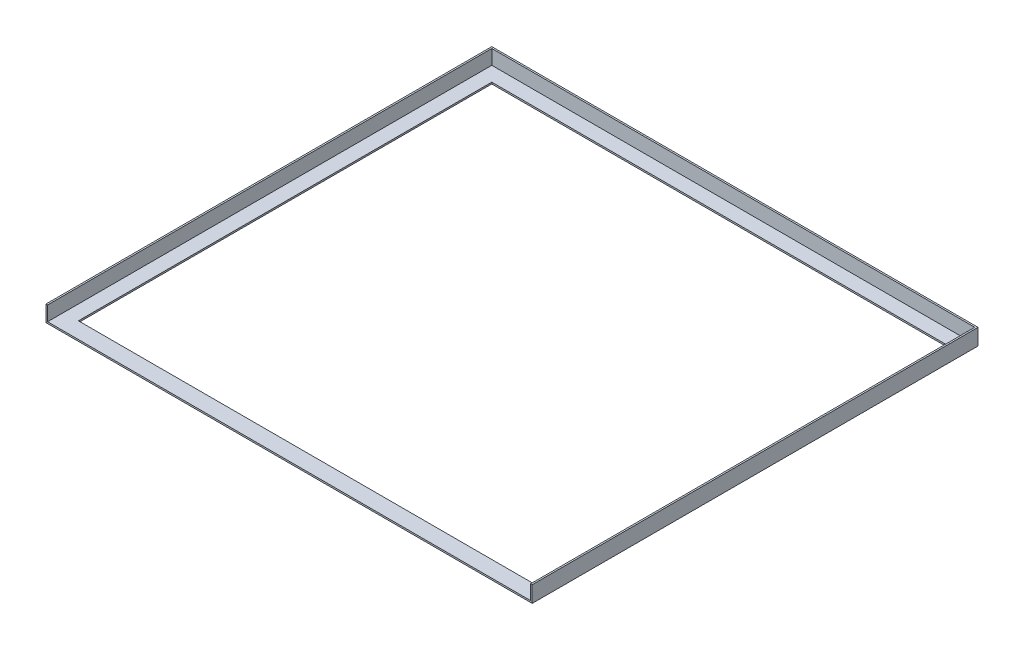
ISO-10303-21;
HEADER;
FILE_DESCRIPTION(('STEP AP214'),'2;1');
FILE_NAME('part.step','',(''),(''),'','','');
FILE_SCHEMA(('AUTOMOTIVE_DESIGN { 1 0 10303 214 1 1 1 1 }'));
ENDSEC;
DATA;
#1=APPLICATION_CONTEXT('core data for automotive mechanical design processes');
#2=APPLICATION_PROTOCOL_DEFINITION('international standard','automotive_design',2000,#1);
#3=PRODUCT_CONTEXT('',#1,'mechanical');
#4=PRODUCT('Part','Part','',(#3));
#5=PRODUCT_RELATED_PRODUCT_CATEGORY('part','',(#4));
#6=PRODUCT_DEFINITION_FORMATION('','',#4);
#7=PRODUCT_DEFINITION_CONTEXT('part definition',#1,'design');
#8=PRODUCT_DEFINITION('design','',#6,#7);
#9=PRODUCT_DEFINITION_SHAPE('','',#8);
#10=(LENGTH_UNIT() NAMED_UNIT(*) SI_UNIT(.MILLI.,.METRE.));
#11=(NAMED_UNIT(*) PLANE_ANGLE_UNIT() SI_UNIT($,.RADIAN.));
#12=(NAMED_UNIT(*) SI_UNIT($,.STERADIAN.) SOLID_ANGLE_UNIT());
#13=UNCERTAINTY_MEASURE_WITH_UNIT(LENGTH_MEASURE(1.E-05),#10,'distance_accuracy_value','');
#14=(GEOMETRIC_REPRESENTATION_CONTEXT(3) GLOBAL_UNCERTAINTY_ASSIGNED_CONTEXT((#13)) GLOBAL_UNIT_ASSIGNED_CONTEXT((#10,
#11,#12)) REPRESENTATION_CONTEXT('',''));
#15=CARTESIAN_POINT('',(0.,0.,0.));
#16=DIRECTION('',(0.,0.,1.));
#17=DIRECTION('',(1.,0.,0.));
#18=AXIS2_PLACEMENT_3D('',#15,#16,#17);
#19=CARTESIAN_POINT('',(-78.9001000112778,15.6650035046458,-550.1));
#20=DIRECTION('',(-1.,0.,0.));
#21=DIRECTION('',(0.,0.,1.));
#22=AXIS2_PLACEMENT_3D('',#19,#20,#21);
#23=PLANE('',#22);
#24=DIRECTION('',(0.,-1.,0.));
#25=VECTOR('',#24,1.);
#26=CARTESIAN_POINT('',(-78.9001000112778,15.6650035046458,0.));
#27=LINE('',#26,#25);
#28=CARTESIAN_POINT('',(-78.9001000112778,15.6650035046458,0.));
#29=VERTEX_POINT('',#28);
#30=CARTESIAN_POINT('',(-78.9001000112778,-4.33499649535423,0.));
#31=VERTEX_POINT('',#30);
#32=EDGE_CURVE('E182',#29,#31,#27,.T.);
#33=ORIENTED_EDGE('',*,*,#32,.F.);
#34=DIRECTION('',(0.,0.,1.));
#35=VECTOR('',#34,1.);
#36=CARTESIAN_POINT('',(-78.9001000112778,15.6650035046458,-550.1));
#37=LINE('',#36,#35);
#38=CARTESIAN_POINT('',(-78.9001000112778,15.6650035046458,-550.1));
#39=VERTEX_POINT('',#38);
#40=EDGE_CURVE('E12',#39,#29,#37,.T.);
#41=ORIENTED_EDGE('',*,*,#40,.F.);
#42=DIRECTION('',(0.,-1.,0.));
#43=VECTOR('',#42,1.);
#44=CARTESIAN_POINT('',(-78.9001000112778,15.6650035046458,-550.1));
#45=LINE('',#44,#43);
#46=CARTESIAN_POINT('',(-78.9001000112778,-4.33499649535423,-550.1));
#47=VERTEX_POINT('',#46);
#48=EDGE_CURVE('E160',#39,#47,#45,.T.);
#49=ORIENTED_EDGE('',*,*,#48,.T.);
#50=DIRECTION('',(0.,0.,1.));
#51=VECTOR('',#50,1.);
#52=CARTESIAN_POINT('',(-78.9001000112778,-4.33499649535423,-550.1));
#53=LINE('',#52,#51);
#54=EDGE_CURVE('E44',#47,#31,#53,.T.);
#55=ORIENTED_EDGE('',*,*,#54,.T.);
#56=EDGE_LOOP('',(#33,#41,#49,#55));
#57=FACE_BOUND('',#56,.T.);
#58=ADVANCED_FACE('F41',(#57),#23,.T.);
#59=CARTESIAN_POINT('',(-78.9001000112778,15.6650035046458,-550.1));
#60=DIRECTION('',(0.,1.,0.));
#61=DIRECTION('',(0.,0.,1.));
#62=AXIS2_PLACEMENT_3D('',#59,#60,#61);
#63=PLANE('',#62);
#64=DIRECTION('',(-1.,0.,0.));
#65=VECTOR('',#64,1.);
#66=CARTESIAN_POINT('',(-78.9001000112778,15.6650035046458,0.));
#67=LINE('',#66,#65);
#68=CARTESIAN_POINT('',(-76.9001000112778,15.6650035046458,0.));
#69=VERTEX_POINT('',#68);
#70=EDGE_CURVE('E147',#69,#29,#67,.T.);
#71=ORIENTED_EDGE('',*,*,#70,.F.);
#72=DIRECTION('',(0.,0.,-1.));
#73=VECTOR('',#72,1.);
#74=CARTESIAN_POINT('',(-76.9001000112778,15.6650035046458,-548.1));
#75=LINE('',#74,#73);
#76=CARTESIAN_POINT('',(-76.9001000112778,15.6650035046458,-548.1));
#77=VERTEX_POINT('',#76);
#78=EDGE_CURVE('E131',#69,#77,#75,.T.);
#79=ORIENTED_EDGE('',*,*,#78,.T.);
#80=DIRECTION('',(1.,0.,0.));
#81=VECTOR('',#80,1.);
#82=CARTESIAN_POINT('',(519.099899988722,15.6650035046458,-548.1));
#83=LINE('',#82,#81);
#84=CARTESIAN_POINT('',(519.099899988722,15.6650035046458,-548.1));
#85=VERTEX_POINT('',#84);
#86=EDGE_CURVE('E197',#77,#85,#83,.T.);
#87=ORIENTED_EDGE('',*,*,#86,.T.);
#88=DIRECTION('',(0.,0.,1.));
#89=VECTOR('',#88,1.);
#90=CARTESIAN_POINT('',(519.099899988722,15.6650035046458,-548.1));
#91=LINE('',#90,#89);
#92=CARTESIAN_POINT('',(519.099899988722,15.6650035046458,0.));
#93=VERTEX_POINT('',#92);
#94=EDGE_CURVE('E183',#85,#93,#91,.T.);
#95=ORIENTED_EDGE('',*,*,#94,.T.);
#96=CARTESIAN_POINT('',(521.099899988722,15.6650035046458,0.));
#97=VERTEX_POINT('',#96);
#98=EDGE_CURVE('E156',#97,#93,#67,.T.);
#99=ORIENTED_EDGE('',*,*,#98,.F.);
#100=DIRECTION('',(0.,0.,1.));
#101=VECTOR('',#100,1.);
#102=CARTESIAN_POINT('',(521.099899988722,15.6650035046458,-550.1));
#103=LINE('',#102,#101);
#104=CARTESIAN_POINT('',(521.099899988722,15.6650035046458,-550.1));
#105=VERTEX_POINT('',#104);
#106=EDGE_CURVE('E49',#105,#97,#103,.T.);
#107=ORIENTED_EDGE('',*,*,#106,.F.);
#108=DIRECTION('',(-1.,0.,0.));
#109=VECTOR('',#108,1.);
#110=CARTESIAN_POINT('',(-78.9001000112778,15.6650035046458,-550.1));
#111=LINE('',#110,#109);
#112=EDGE_CURVE('E171',#105,#39,#111,.T.);
#113=ORIENTED_EDGE('',*,*,#112,.T.);
#114=ORIENTED_EDGE('',*,*,#40,.T.);
#115=EDGE_LOOP('',(#71,#79,#87,#95,#99,#107,#113,#114));
#116=FACE_BOUND('',#115,.T.);
#117=ADVANCED_FACE('F153',(#116),#63,.T.);
#118=CARTESIAN_POINT('',(521.099899988722,15.6650035046458,-550.1));
#119=DIRECTION('',(1.,0.,0.));
#120=DIRECTION('',(0.,0.,-1.));
#121=AXIS2_PLACEMENT_3D('',#118,#119,#120);
#122=PLANE('',#121);
#123=DIRECTION('',(0.,1.,0.));
#124=VECTOR('',#123,1.);
#125=CARTESIAN_POINT('',(521.099899988722,15.6650035046458,0.));
#126=LINE('',#125,#124);
#127=CARTESIAN_POINT('',(521.099899988722,-4.33499649535423,0.));
#128=VERTEX_POINT('',#127);
#129=EDGE_CURVE('E157',#128,#97,#126,.T.);
#130=ORIENTED_EDGE('',*,*,#129,.F.);
#131=DIRECTION('',(0.,0.,1.));
#132=VECTOR('',#131,1.);
#133=CARTESIAN_POINT('',(521.099899988722,-4.33499649535423,-550.1));
#134=LINE('',#133,#132);
#135=CARTESIAN_POINT('',(521.099899988722,-4.33499649535423,-550.1));
#136=VERTEX_POINT('',#135);
#137=EDGE_CURVE('E166',#136,#128,#134,.T.);
#138=ORIENTED_EDGE('',*,*,#137,.F.);
#139=DIRECTION('',(0.,1.,0.));
#140=VECTOR('',#139,1.);
#141=CARTESIAN_POINT('',(521.099899988722,15.6650035046458,-550.1));
#142=LINE('',#141,#140);
#143=EDGE_CURVE('E174',#136,#105,#142,.T.);
#144=ORIENTED_EDGE('',*,*,#143,.T.);
#145=ORIENTED_EDGE('',*,*,#106,.T.);
#146=EDGE_LOOP('',(#130,#138,#144,#145));
#147=FACE_BOUND('',#146,.T.);
#148=ADVANCED_FACE('F285',(#147),#122,.T.);
#149=CARTESIAN_POINT('',(-78.9001000112778,-4.33499649535423,-550.1));
#150=DIRECTION('',(0.,-1.,0.));
#151=DIRECTION('',(1.,0.,0.));
#152=AXIS2_PLACEMENT_3D('',#149,#150,#151);
#153=PLANE('',#152);
#154=DIRECTION('',(-1.,0.,0.));
#155=VECTOR('',#154,1.);
#156=CARTESIAN_POINT('',(501.099899988722,-4.33499649535428,-20.));
#157=LINE('',#156,#155);
#158=CARTESIAN_POINT('',(501.099899988722,-4.33499649535428,-20.));
#159=VERTEX_POINT('',#158);
#160=CARTESIAN_POINT('',(-58.9001000112778,-4.33499649535423,-20.));
#161=VERTEX_POINT('',#160);
#162=EDGE_CURVE('E228',#159,#161,#157,.T.);
#163=ORIENTED_EDGE('',*,*,#162,.F.);
#164=DIRECTION('',(0.,0.,1.));
#165=VECTOR('',#164,1.);
#166=CARTESIAN_POINT('',(501.099899988722,-4.33499649535428,-530.1));
#167=LINE('',#166,#165);
#168=CARTESIAN_POINT('',(501.099899988722,-4.33499649535428,-530.1));
#169=VERTEX_POINT('',#168);
#170=EDGE_CURVE('E231',#169,#159,#167,.T.);
#171=ORIENTED_EDGE('',*,*,#170,.F.);
#172=DIRECTION('',(1.,0.,0.));
#173=VECTOR('',#172,1.);
#174=CARTESIAN_POINT('',(-58.9001000112778,-4.33499649535428,-530.1));
#175=LINE('',#174,#173);
#176=CARTESIAN_POINT('',(-58.9001000112778,-4.33499649535428,-530.1));
#177=VERTEX_POINT('',#176);
#178=EDGE_CURVE('E239',#177,#169,#175,.T.);
#179=ORIENTED_EDGE('',*,*,#178,.F.);
#180=DIRECTION('',(0.,0.,-1.));
#181=VECTOR('',#180,1.);
#182=CARTESIAN_POINT('',(-58.9001000112778,-4.33499649535428,-20.));
#183=LINE('',#182,#181);
#184=EDGE_CURVE('E249',#161,#177,#183,.T.);
#185=ORIENTED_EDGE('',*,*,#184,.F.);
#186=EDGE_LOOP('',(#163,#171,#179,#185));
#187=FACE_BOUND('',#186,.T.);
#188=DIRECTION('',(1.,0.,0.));
#189=VECTOR('',#188,1.);
#190=CARTESIAN_POINT('',(-78.9001000112778,-4.33499649535423,0.));
#191=LINE('',#190,#189);
#192=EDGE_CURVE('E162',#31,#128,#191,.T.);
#193=ORIENTED_EDGE('',*,*,#192,.F.);
#194=ORIENTED_EDGE('',*,*,#54,.F.);
#195=DIRECTION('',(1.,0.,0.));
#196=VECTOR('',#195,1.);
#197=CARTESIAN_POINT('',(-78.9001000112778,-4.33499649535423,-550.1));
#198=LINE('',#197,#196);
#199=EDGE_CURVE('E178',#47,#136,#198,.T.);
#200=ORIENTED_EDGE('',*,*,#199,.T.);
#201=ORIENTED_EDGE('',*,*,#137,.T.);
#202=EDGE_LOOP('',(#193,#194,#200,#201));
#203=FACE_BOUND('',#202,.T.);
#204=ADVANCED_FACE('F186',(#187,#203),#153,.T.);
#205=CARTESIAN_POINT('',(0.,0.,-550.1));
#206=DIRECTION('',(0.,0.,1.));
#207=DIRECTION('',(1.,0.,0.));
#208=AXIS2_PLACEMENT_3D('',#205,#206,#207);
#209=PLANE('',#208);
#210=ORIENTED_EDGE('',*,*,#48,.F.);
#211=ORIENTED_EDGE('',*,*,#112,.F.);
#212=ORIENTED_EDGE('',*,*,#143,.F.);
#213=ORIENTED_EDGE('',*,*,#199,.F.);
#214=EDGE_LOOP('',(#210,#211,#212,#213));
#215=FACE_BOUND('',#214,.T.);
#216=ADVANCED_FACE('F191',(#215),#209,.F.);
#217=CARTESIAN_POINT('',(0.,0.,0.));
#218=DIRECTION('',(0.,0.,1.));
#219=DIRECTION('',(1.,0.,0.));
#220=AXIS2_PLACEMENT_3D('',#217,#218,#219);
#221=PLANE('',#220);
#222=DIRECTION('',(0.,1.,0.));
#223=VECTOR('',#222,1.);
#224=CARTESIAN_POINT('',(-76.9001000112778,15.6650035046458,0.));
#225=LINE('',#224,#223);
#226=CARTESIAN_POINT('',(-76.9001000112778,-2.33499649535423,0.));
#227=VERTEX_POINT('',#226);
#228=EDGE_CURVE('E134',#227,#69,#225,.T.);
#229=ORIENTED_EDGE('',*,*,#228,.T.);
#230=ORIENTED_EDGE('',*,*,#70,.T.);
#231=ORIENTED_EDGE('',*,*,#32,.T.);
#232=ORIENTED_EDGE('',*,*,#192,.T.);
#233=ORIENTED_EDGE('',*,*,#129,.T.);
#234=ORIENTED_EDGE('',*,*,#98,.T.);
#235=DIRECTION('',(0.,-1.,0.));
#236=VECTOR('',#235,1.);
#237=CARTESIAN_POINT('',(519.099899988722,15.6650035046458,0.));
#238=LINE('',#237,#236);
#239=CARTESIAN_POINT('',(519.099899988722,-2.33499649535423,0.));
#240=VERTEX_POINT('',#239);
#241=EDGE_CURVE('E151',#93,#240,#238,.T.);
#242=ORIENTED_EDGE('',*,*,#241,.T.);
#243=DIRECTION('',(-1.,0.,0.));
#244=VECTOR('',#243,1.);
#245=CARTESIAN_POINT('',(-76.9001000112778,-2.33499649535423,0.));
#246=LINE('',#245,#244);
#247=EDGE_CURVE('E150',#240,#227,#246,.T.);
#248=ORIENTED_EDGE('',*,*,#247,.T.);
#249=EDGE_LOOP('',(#229,#230,#231,#232,#233,#234,#242,#248));
#250=FACE_BOUND('',#249,.T.);
#251=ADVANCED_FACE('F145',(#250),#221,.T.);
#252=CARTESIAN_POINT('',(0.,-2.33499649535428,0.));
#253=DIRECTION('',(0.,-1.,0.));
#254=DIRECTION('',(0.,0.,-1.));
#255=AXIS2_PLACEMENT_3D('',#252,#253,#254);
#256=PLANE('',#255);
#257=DIRECTION('',(0.,0.,1.));
#258=VECTOR('',#257,1.);
#259=CARTESIAN_POINT('',(501.099899988722,-2.33499649535428,-530.1));
#260=LINE('',#259,#258);
#261=CARTESIAN_POINT('',(501.099899988722,-2.33499649535428,-530.1));
#262=VERTEX_POINT('',#261);
#263=CARTESIAN_POINT('',(501.099899988722,-2.33499649535428,-20.));
#264=VERTEX_POINT('',#263);
#265=EDGE_CURVE('E236',#262,#264,#260,.T.);
#266=ORIENTED_EDGE('',*,*,#265,.T.);
#267=DIRECTION('',(-1.,0.,0.));
#268=VECTOR('',#267,1.);
#269=CARTESIAN_POINT('',(501.099899988722,-2.33499649535428,-20.));
#270=LINE('',#269,#268);
#271=CARTESIAN_POINT('',(-58.9001000112778,-2.33499649535428,-20.));
#272=VERTEX_POINT('',#271);
#273=EDGE_CURVE('E227',#264,#272,#270,.T.);
#274=ORIENTED_EDGE('',*,*,#273,.T.);
#275=DIRECTION('',(0.,0.,-1.));
#276=VECTOR('',#275,1.);
#277=CARTESIAN_POINT('',(-58.9001000112778,-2.33499649535428,-20.));
#278=LINE('',#277,#276);
#279=CARTESIAN_POINT('',(-58.9001000112778,-2.33499649535428,-530.1));
#280=VERTEX_POINT('',#279);
#281=EDGE_CURVE('E211',#272,#280,#278,.T.);
#282=ORIENTED_EDGE('',*,*,#281,.T.);
#283=DIRECTION('',(1.,0.,0.));
#284=VECTOR('',#283,1.);
#285=CARTESIAN_POINT('',(-58.9001000112778,-2.33499649535428,-530.1));
#286=LINE('',#285,#284);
#287=EDGE_CURVE('E251',#280,#262,#286,.T.);
#288=ORIENTED_EDGE('',*,*,#287,.T.);
#289=EDGE_LOOP('',(#266,#274,#282,#288));
#290=FACE_BOUND('',#289,.T.);
#291=DIRECTION('',(1.,0.,0.));
#292=VECTOR('',#291,1.);
#293=CARTESIAN_POINT('',(519.099899988722,-2.33499649535423,-548.1));
#294=LINE('',#293,#292);
#295=CARTESIAN_POINT('',(-76.9001000112778,-2.33499649535423,-548.1));
#296=VERTEX_POINT('',#295);
#297=CARTESIAN_POINT('',(519.099899988722,-2.33499649535423,-548.1));
#298=VERTEX_POINT('',#297);
#299=EDGE_CURVE('E198',#296,#298,#294,.T.);
#300=ORIENTED_EDGE('',*,*,#299,.F.);
#301=DIRECTION('',(0.,0.,-1.));
#302=VECTOR('',#301,1.);
#303=CARTESIAN_POINT('',(-76.9001000112778,-2.33499649535423,-548.1));
#304=LINE('',#303,#302);
#305=EDGE_CURVE('E142',#227,#296,#304,.T.);
#306=ORIENTED_EDGE('',*,*,#305,.F.);
#307=ORIENTED_EDGE('',*,*,#247,.F.);
#308=DIRECTION('',(0.,0.,1.));
#309=VECTOR('',#308,1.);
#310=CARTESIAN_POINT('',(519.099899988722,-2.33499649535423,-548.1));
#311=LINE('',#310,#309);
#312=EDGE_CURVE('E141',#298,#240,#311,.T.);
#313=ORIENTED_EDGE('',*,*,#312,.F.);
#314=EDGE_LOOP('',(#300,#306,#307,#313));
#315=FACE_BOUND('',#314,.T.);
#316=ADVANCED_FACE('F281',(#290,#315),#256,.F.);
#317=CARTESIAN_POINT('',(519.099899988722,15.6650035046458,-548.1));
#318=DIRECTION('',(0.,0.,-1.));
#319=DIRECTION('',(-1.,0.,0.));
#320=AXIS2_PLACEMENT_3D('',#317,#318,#319);
#321=PLANE('',#320);
#322=ORIENTED_EDGE('',*,*,#299,.T.);
#323=DIRECTION('',(0.,-1.,0.));
#324=VECTOR('',#323,1.);
#325=CARTESIAN_POINT('',(519.099899988722,15.6650035046458,-548.1));
#326=LINE('',#325,#324);
#327=EDGE_CURVE('E202',#85,#298,#326,.T.);
#328=ORIENTED_EDGE('',*,*,#327,.F.);
#329=ORIENTED_EDGE('',*,*,#86,.F.);
#330=DIRECTION('',(0.,-1.,0.));
#331=VECTOR('',#330,1.);
#332=CARTESIAN_POINT('',(-76.9001000112778,15.6650035046458,-548.1));
#333=LINE('',#332,#331);
#334=EDGE_CURVE('E137',#77,#296,#333,.T.);
#335=ORIENTED_EDGE('',*,*,#334,.T.);
#336=EDGE_LOOP('',(#322,#328,#329,#335));
#337=FACE_BOUND('',#336,.T.);
#338=ADVANCED_FACE('F283',(#337),#321,.F.);
#339=CARTESIAN_POINT('',(-76.9001000112778,15.6650035046458,-548.1));
#340=DIRECTION('',(-1.,0.,0.));
#341=DIRECTION('',(0.,0.,1.));
#342=AXIS2_PLACEMENT_3D('',#339,#340,#341);
#343=PLANE('',#342);
#344=ORIENTED_EDGE('',*,*,#305,.T.);
#345=ORIENTED_EDGE('',*,*,#334,.F.);
#346=ORIENTED_EDGE('',*,*,#78,.F.);
#347=ORIENTED_EDGE('',*,*,#228,.F.);
#348=EDGE_LOOP('',(#344,#345,#346,#347));
#349=FACE_BOUND('',#348,.T.);
#350=ADVANCED_FACE('F133',(#349),#343,.F.);
#351=CARTESIAN_POINT('',(519.099899988722,15.6650035046458,-548.1));
#352=DIRECTION('',(1.,0.,0.));
#353=DIRECTION('',(0.,0.,-1.));
#354=AXIS2_PLACEMENT_3D('',#351,#352,#353);
#355=PLANE('',#354);
#356=ORIENTED_EDGE('',*,*,#312,.T.);
#357=ORIENTED_EDGE('',*,*,#241,.F.);
#358=ORIENTED_EDGE('',*,*,#94,.F.);
#359=ORIENTED_EDGE('',*,*,#327,.T.);
#360=EDGE_LOOP('',(#356,#357,#358,#359));
#361=FACE_BOUND('',#360,.T.);
#362=ADVANCED_FACE('F276',(#361),#355,.F.);
#363=CARTESIAN_POINT('',(501.099899988722,-2.33499649535428,-20.));
#364=DIRECTION('',(0.,0.,1.));
#365=DIRECTION('',(1.,0.,0.));
#366=AXIS2_PLACEMENT_3D('',#363,#364,#365);
#367=PLANE('',#366);
#368=ORIENTED_EDGE('',*,*,#162,.T.);
#369=DIRECTION('',(0.,-1.,0.));
#370=VECTOR('',#369,1.);
#371=CARTESIAN_POINT('',(-58.9001000112778,-2.33499649535428,-20.));
#372=LINE('',#371,#370);
#373=EDGE_CURVE('E62',#272,#161,#372,.T.);
#374=ORIENTED_EDGE('',*,*,#373,.F.);
#375=ORIENTED_EDGE('',*,*,#273,.F.);
#376=DIRECTION('',(0.,-1.,0.));
#377=VECTOR('',#376,1.);
#378=CARTESIAN_POINT('',(501.099899988722,-2.33499649535428,-20.));
#379=LINE('',#378,#377);
#380=EDGE_CURVE('E224',#264,#159,#379,.T.);
#381=ORIENTED_EDGE('',*,*,#380,.T.);
#382=EDGE_LOOP('',(#368,#374,#375,#381));
#383=FACE_BOUND('',#382,.T.);
#384=ADVANCED_FACE('F343',(#383),#367,.F.);
#385=CARTESIAN_POINT('',(501.099899988722,-2.33499649535428,-530.1));
#386=DIRECTION('',(1.,0.,0.));
#387=DIRECTION('',(0.,0.,-1.));
#388=AXIS2_PLACEMENT_3D('',#385,#386,#387);
#389=PLANE('',#388);
#390=ORIENTED_EDGE('',*,*,#170,.T.);
#391=ORIENTED_EDGE('',*,*,#380,.F.);
#392=ORIENTED_EDGE('',*,*,#265,.F.);
#393=DIRECTION('',(0.,-1.,0.));
#394=VECTOR('',#393,1.);
#395=CARTESIAN_POINT('',(501.099899988722,-2.33499649535428,-530.1));
#396=LINE('',#395,#394);
#397=EDGE_CURVE('E233',#262,#169,#396,.T.);
#398=ORIENTED_EDGE('',*,*,#397,.T.);
#399=EDGE_LOOP('',(#390,#391,#392,#398));
#400=FACE_BOUND('',#399,.T.);
#401=ADVANCED_FACE('F360',(#400),#389,.F.);
#402=CARTESIAN_POINT('',(-58.9001000112778,-2.33499649535428,-530.1));
#403=DIRECTION('',(0.,0.,-1.));
#404=DIRECTION('',(-1.,0.,0.));
#405=AXIS2_PLACEMENT_3D('',#402,#403,#404);
#406=PLANE('',#405);
#407=ORIENTED_EDGE('',*,*,#178,.T.);
#408=ORIENTED_EDGE('',*,*,#397,.F.);
#409=ORIENTED_EDGE('',*,*,#287,.F.);
#410=DIRECTION('',(0.,-1.,0.));
#411=VECTOR('',#410,1.);
#412=CARTESIAN_POINT('',(-58.9001000112778,-2.33499649535428,-530.1));
#413=LINE('',#412,#411);
#414=EDGE_CURVE('E57',#280,#177,#413,.T.);
#415=ORIENTED_EDGE('',*,*,#414,.T.);
#416=EDGE_LOOP('',(#407,#408,#409,#415));
#417=FACE_BOUND('',#416,.T.);
#418=ADVANCED_FACE('F370',(#417),#406,.F.);
#419=CARTESIAN_POINT('',(-58.9001000112778,-2.33499649535428,-20.));
#420=DIRECTION('',(-1.,0.,0.));
#421=DIRECTION('',(0.,0.,1.));
#422=AXIS2_PLACEMENT_3D('',#419,#420,#421);
#423=PLANE('',#422);
#424=ORIENTED_EDGE('',*,*,#184,.T.);
#425=ORIENTED_EDGE('',*,*,#414,.F.);
#426=ORIENTED_EDGE('',*,*,#281,.F.);
#427=ORIENTED_EDGE('',*,*,#373,.T.);
#428=EDGE_LOOP('',(#424,#425,#426,#427));
#429=FACE_BOUND('',#428,.T.);
#430=ADVANCED_FACE('F308',(#429),#423,.F.);
#431=CLOSED_SHELL('',(#58,#117,#148,#204,#216,#251,#316,#338,#350,#362,#384,#401,#418,#430));
#432=MANIFOLD_SOLID_BREP('B2',#431);
#433=ADVANCED_BREP_SHAPE_REPRESENTATION('',(#18,#432),#14);
#434=SHAPE_DEFINITION_REPRESENTATION(#9,#433);
ENDSEC;
END-ISO-10303-21;
